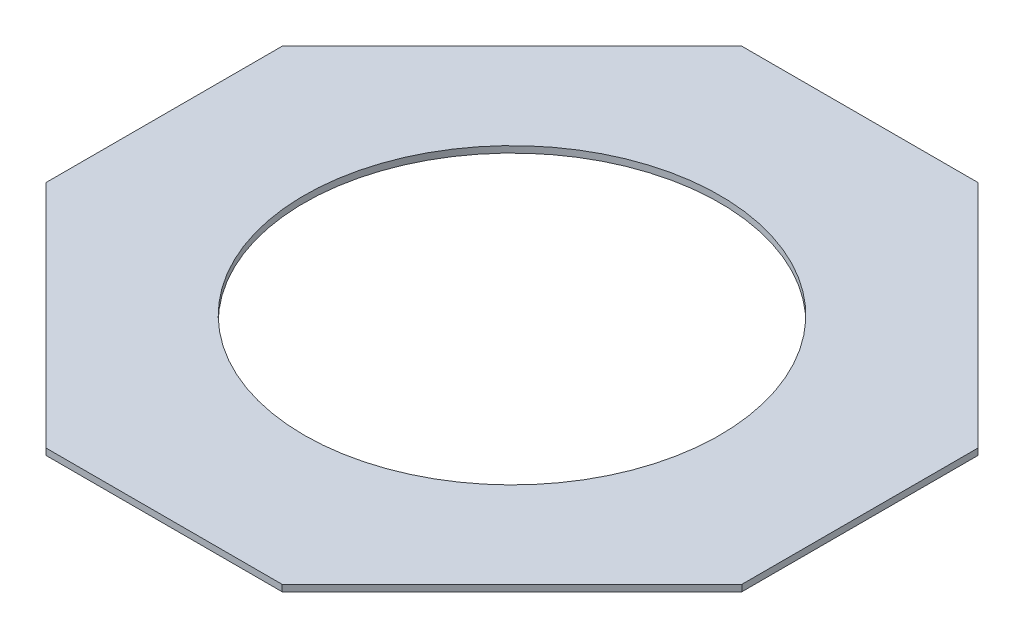
ISO-10303-21;
HEADER;
FILE_DESCRIPTION(('STEP AP214'),'2;1');
FILE_NAME('part.step','',(''),(''),'','','');
FILE_SCHEMA(('AUTOMOTIVE_DESIGN { 1 0 10303 214 1 1 1 1 }'));
ENDSEC;
DATA;
#1=APPLICATION_CONTEXT('core data for automotive mechanical design processes');
#2=APPLICATION_PROTOCOL_DEFINITION('international standard','automotive_design',2000,#1);
#3=PRODUCT_CONTEXT('',#1,'mechanical');
#4=PRODUCT('Part','Part','',(#3));
#5=PRODUCT_RELATED_PRODUCT_CATEGORY('part','',(#4));
#6=PRODUCT_DEFINITION_FORMATION('','',#4);
#7=PRODUCT_DEFINITION_CONTEXT('part definition',#1,'design');
#8=PRODUCT_DEFINITION('design','',#6,#7);
#9=PRODUCT_DEFINITION_SHAPE('','',#8);
#10=(LENGTH_UNIT() NAMED_UNIT(*) SI_UNIT(.MILLI.,.METRE.));
#11=(NAMED_UNIT(*) PLANE_ANGLE_UNIT() SI_UNIT($,.RADIAN.));
#12=(NAMED_UNIT(*) SI_UNIT($,.STERADIAN.) SOLID_ANGLE_UNIT());
#13=UNCERTAINTY_MEASURE_WITH_UNIT(LENGTH_MEASURE(1.E-05),#10,'distance_accuracy_value','');
#14=(GEOMETRIC_REPRESENTATION_CONTEXT(3) GLOBAL_UNCERTAINTY_ASSIGNED_CONTEXT((#13)) GLOBAL_UNIT_ASSIGNED_CONTEXT((#10,
#11,#12)) REPRESENTATION_CONTEXT('',''));
#15=CARTESIAN_POINT('',(0.,0.,0.));
#16=DIRECTION('',(0.,0.,1.));
#17=DIRECTION('',(1.,0.,0.));
#18=AXIS2_PLACEMENT_3D('',#15,#16,#17);
#19=CARTESIAN_POINT('',(0.,1.3,0.));
#20=DIRECTION('',(0.,1.,0.));
#21=DIRECTION('',(0.,0.,1.));
#22=AXIS2_PLACEMENT_3D('',#19,#20,#21);
#23=PLANE('',#22);
#24=DIRECTION('',(-0.707106781186547,0.,0.707106781186547));
#25=VECTOR('',#24,1.);
#26=CARTESIAN_POINT('',(70.,1.3,23.75));
#27=LINE('',#26,#25);
#28=CARTESIAN_POINT('',(70.,1.3,23.75));
#29=VERTEX_POINT('',#28);
#30=CARTESIAN_POINT('',(23.75,1.3,70.));
#31=VERTEX_POINT('',#30);
#32=EDGE_CURVE('E187',#29,#31,#27,.T.);
#33=ORIENTED_EDGE('',*,*,#32,.F.);
#34=DIRECTION('',(0.,0.,-1.));
#35=VECTOR('',#34,1.);
#36=CARTESIAN_POINT('',(70.,1.3,23.75));
#37=LINE('',#36,#35);
#38=CARTESIAN_POINT('',(70.,1.3,-23.75));
#39=VERTEX_POINT('',#38);
#40=EDGE_CURVE('E146',#29,#39,#37,.T.);
#41=ORIENTED_EDGE('',*,*,#40,.T.);
#42=DIRECTION('',(-0.707106781186547,0.,-0.707106781186547));
#43=VECTOR('',#42,1.);
#44=CARTESIAN_POINT('',(70.,1.3,-23.75));
#45=LINE('',#44,#43);
#46=CARTESIAN_POINT('',(23.75,1.3,-70.));
#47=VERTEX_POINT('',#46);
#48=EDGE_CURVE('E138',#39,#47,#45,.T.);
#49=ORIENTED_EDGE('',*,*,#48,.T.);
#50=DIRECTION('',(-1.,0.,0.));
#51=VECTOR('',#50,1.);
#52=CARTESIAN_POINT('',(23.75,1.3,-70.));
#53=LINE('',#52,#51);
#54=CARTESIAN_POINT('',(-23.75,1.3,-70.));
#55=VERTEX_POINT('',#54);
#56=EDGE_CURVE('E144',#47,#55,#53,.T.);
#57=ORIENTED_EDGE('',*,*,#56,.T.);
#58=DIRECTION('',(0.707106781186547,0.,-0.707106781186547));
#59=VECTOR('',#58,1.);
#60=CARTESIAN_POINT('',(-70.,1.3,-23.75));
#61=LINE('',#60,#59);
#62=CARTESIAN_POINT('',(-70.,1.3,-23.75));
#63=VERTEX_POINT('',#62);
#64=EDGE_CURVE('E161',#63,#55,#61,.T.);
#65=ORIENTED_EDGE('',*,*,#64,.F.);
#66=DIRECTION('',(0.,0.,-1.));
#67=VECTOR('',#66,1.);
#68=CARTESIAN_POINT('',(-70.,1.3,23.75));
#69=LINE('',#68,#67);
#70=CARTESIAN_POINT('',(-70.,1.3,23.75));
#71=VERTEX_POINT('',#70);
#72=EDGE_CURVE('E163',#71,#63,#69,.T.);
#73=ORIENTED_EDGE('',*,*,#72,.F.);
#74=DIRECTION('',(0.707106781186547,0.,0.707106781186547));
#75=VECTOR('',#74,1.);
#76=CARTESIAN_POINT('',(-70.,1.3,23.75));
#77=LINE('',#76,#75);
#78=CARTESIAN_POINT('',(-23.75,1.3,70.));
#79=VERTEX_POINT('',#78);
#80=EDGE_CURVE('E210',#71,#79,#77,.T.);
#81=ORIENTED_EDGE('',*,*,#80,.T.);
#82=DIRECTION('',(-1.,0.,0.));
#83=VECTOR('',#82,1.);
#84=CARTESIAN_POINT('',(23.75,1.3,70.));
#85=LINE('',#84,#83);
#86=EDGE_CURVE('E211',#31,#79,#85,.T.);
#87=ORIENTED_EDGE('',*,*,#86,.F.);
#88=EDGE_LOOP('',(#33,#41,#49,#57,#65,#73,#81,#87));
#89=FACE_BOUND('',#88,.T.);
#90=CARTESIAN_POINT('',(0.,1.3,0.));
#91=DIRECTION('',(0.,1.,0.));
#92=DIRECTION('',(0.,0.,1.));
#93=AXIS2_PLACEMENT_3D('',#90,#91,#92);
#94=CIRCLE('',#93,41.8);
#95=CARTESIAN_POINT('',(0.,1.3,41.8));
#96=VERTEX_POINT('',#95);
#97=EDGE_CURVE('E172',#96,#96,#94,.T.);
#98=ORIENTED_EDGE('',*,*,#97,.F.);
#99=EDGE_LOOP('',(#98));
#100=FACE_BOUND('',#99,.T.);
#101=ADVANCED_FACE('F68',(#89,#100),#23,.T.);
#102=CARTESIAN_POINT('',(0.,0.,0.));
#103=DIRECTION('',(0.,1.,0.));
#104=DIRECTION('',(0.,0.,1.));
#105=AXIS2_PLACEMENT_3D('',#102,#103,#104);
#106=PLANE('',#105);
#107=DIRECTION('',(-0.707106781186547,0.,0.707106781186547));
#108=VECTOR('',#107,1.);
#109=CARTESIAN_POINT('',(70.,0.,23.75));
#110=LINE('',#109,#108);
#111=CARTESIAN_POINT('',(70.,0.,23.75));
#112=VERTEX_POINT('',#111);
#113=CARTESIAN_POINT('',(23.75,0.,70.));
#114=VERTEX_POINT('',#113);
#115=EDGE_CURVE('E168',#112,#114,#110,.T.);
#116=ORIENTED_EDGE('',*,*,#115,.T.);
#117=DIRECTION('',(-1.,0.,0.));
#118=VECTOR('',#117,1.);
#119=CARTESIAN_POINT('',(23.75,0.,70.));
#120=LINE('',#119,#118);
#121=CARTESIAN_POINT('',(-23.75,0.,70.));
#122=VERTEX_POINT('',#121);
#123=EDGE_CURVE('E171',#114,#122,#120,.T.);
#124=ORIENTED_EDGE('',*,*,#123,.T.);
#125=DIRECTION('',(0.707106781186547,0.,0.707106781186547));
#126=VECTOR('',#125,1.);
#127=CARTESIAN_POINT('',(-70.,0.,23.75));
#128=LINE('',#127,#126);
#129=CARTESIAN_POINT('',(-70.,0.,23.75));
#130=VERTEX_POINT('',#129);
#131=EDGE_CURVE('E175',#130,#122,#128,.T.);
#132=ORIENTED_EDGE('',*,*,#131,.F.);
#133=DIRECTION('',(0.,0.,-1.));
#134=VECTOR('',#133,1.);
#135=CARTESIAN_POINT('',(-70.,0.,23.75));
#136=LINE('',#135,#134);
#137=CARTESIAN_POINT('',(-70.,0.,-23.75));
#138=VERTEX_POINT('',#137);
#139=EDGE_CURVE('E178',#130,#138,#136,.T.);
#140=ORIENTED_EDGE('',*,*,#139,.T.);
#141=DIRECTION('',(0.707106781186547,0.,-0.707106781186547));
#142=VECTOR('',#141,1.);
#143=CARTESIAN_POINT('',(-70.,0.,-23.75));
#144=LINE('',#143,#142);
#145=CARTESIAN_POINT('',(-23.75,0.,-70.));
#146=VERTEX_POINT('',#145);
#147=EDGE_CURVE('E181',#138,#146,#144,.T.);
#148=ORIENTED_EDGE('',*,*,#147,.T.);
#149=DIRECTION('',(-1.,0.,0.));
#150=VECTOR('',#149,1.);
#151=CARTESIAN_POINT('',(23.75,0.,-70.));
#152=LINE('',#151,#150);
#153=CARTESIAN_POINT('',(23.75,0.,-70.));
#154=VERTEX_POINT('',#153);
#155=EDGE_CURVE('E184',#154,#146,#152,.T.);
#156=ORIENTED_EDGE('',*,*,#155,.F.);
#157=DIRECTION('',(-0.707106781186547,0.,-0.707106781186547));
#158=VECTOR('',#157,1.);
#159=CARTESIAN_POINT('',(70.,0.,-23.75));
#160=LINE('',#159,#158);
#161=CARTESIAN_POINT('',(70.,0.,-23.75));
#162=VERTEX_POINT('',#161);
#163=EDGE_CURVE('E153',#162,#154,#160,.T.);
#164=ORIENTED_EDGE('',*,*,#163,.F.);
#165=DIRECTION('',(0.,0.,-1.));
#166=VECTOR('',#165,1.);
#167=CARTESIAN_POINT('',(70.,0.,23.75));
#168=LINE('',#167,#166);
#169=EDGE_CURVE('E114',#112,#162,#168,.T.);
#170=ORIENTED_EDGE('',*,*,#169,.F.);
#171=EDGE_LOOP('',(#116,#124,#132,#140,#148,#156,#164,#170));
#172=FACE_BOUND('',#171,.T.);
#173=CARTESIAN_POINT('',(0.,0.,0.));
#174=DIRECTION('',(0.,1.,0.));
#175=DIRECTION('',(0.,0.,1.));
#176=AXIS2_PLACEMENT_3D('',#173,#174,#175);
#177=CIRCLE('',#176,41.8);
#178=CARTESIAN_POINT('',(0.,0.,41.8));
#179=VERTEX_POINT('',#178);
#180=EDGE_CURVE('E216',#179,#179,#177,.T.);
#181=ORIENTED_EDGE('',*,*,#180,.T.);
#182=EDGE_LOOP('',(#181));
#183=FACE_BOUND('',#182,.T.);
#184=ADVANCED_FACE('F199',(#172,#183),#106,.F.);
#185=CARTESIAN_POINT('',(70.,1.3,23.75));
#186=DIRECTION('',(0.707106781186548,0.,0.707106781186548));
#187=DIRECTION('',(0.707106781186548,0.,-0.707106781186548));
#188=AXIS2_PLACEMENT_3D('',#185,#186,#187);
#189=PLANE('',#188);
#190=ORIENTED_EDGE('',*,*,#115,.F.);
#191=DIRECTION('',(0.,-1.,0.));
#192=VECTOR('',#191,1.);
#193=CARTESIAN_POINT('',(70.,1.3,23.75));
#194=LINE('',#193,#192);
#195=EDGE_CURVE('E12',#29,#112,#194,.T.);
#196=ORIENTED_EDGE('',*,*,#195,.F.);
#197=ORIENTED_EDGE('',*,*,#32,.T.);
#198=DIRECTION('',(0.,-1.,0.));
#199=VECTOR('',#198,1.);
#200=CARTESIAN_POINT('',(23.75,1.3,70.));
#201=LINE('',#200,#199);
#202=EDGE_CURVE('E72',#31,#114,#201,.T.);
#203=ORIENTED_EDGE('',*,*,#202,.T.);
#204=EDGE_LOOP('',(#190,#196,#197,#203));
#205=FACE_BOUND('',#204,.T.);
#206=ADVANCED_FACE('F70',(#205),#189,.T.);
#207=CARTESIAN_POINT('',(70.,1.3,23.75));
#208=DIRECTION('',(-1.,0.,0.));
#209=DIRECTION('',(0.,0.,1.));
#210=AXIS2_PLACEMENT_3D('',#207,#208,#209);
#211=PLANE('',#210);
#212=ORIENTED_EDGE('',*,*,#169,.T.);
#213=DIRECTION('',(0.,-1.,0.));
#214=VECTOR('',#213,1.);
#215=CARTESIAN_POINT('',(70.,1.3,-23.75));
#216=LINE('',#215,#214);
#217=EDGE_CURVE('E78',#39,#162,#216,.T.);
#218=ORIENTED_EDGE('',*,*,#217,.F.);
#219=ORIENTED_EDGE('',*,*,#40,.F.);
#220=ORIENTED_EDGE('',*,*,#195,.T.);
#221=EDGE_LOOP('',(#212,#218,#219,#220));
#222=FACE_BOUND('',#221,.T.);
#223=ADVANCED_FACE('F232',(#222),#211,.F.);
#224=CARTESIAN_POINT('',(70.,1.3,-23.75));
#225=DIRECTION('',(-0.707106781186548,0.,0.707106781186548));
#226=DIRECTION('',(0.707106781186548,0.,0.707106781186548));
#227=AXIS2_PLACEMENT_3D('',#224,#225,#226);
#228=PLANE('',#227);
#229=ORIENTED_EDGE('',*,*,#163,.T.);
#230=DIRECTION('',(0.,-1.,0.));
#231=VECTOR('',#230,1.);
#232=CARTESIAN_POINT('',(23.75,1.3,-70.));
#233=LINE('',#232,#231);
#234=EDGE_CURVE('E150',#47,#154,#233,.T.);
#235=ORIENTED_EDGE('',*,*,#234,.F.);
#236=ORIENTED_EDGE('',*,*,#48,.F.);
#237=ORIENTED_EDGE('',*,*,#217,.T.);
#238=EDGE_LOOP('',(#229,#235,#236,#237));
#239=FACE_BOUND('',#238,.T.);
#240=ADVANCED_FACE('F151',(#239),#228,.F.);
#241=CARTESIAN_POINT('',(23.75,1.3,-70.));
#242=DIRECTION('',(0.,0.,1.));
#243=DIRECTION('',(1.,0.,0.));
#244=AXIS2_PLACEMENT_3D('',#241,#242,#243);
#245=PLANE('',#244);
#246=ORIENTED_EDGE('',*,*,#155,.T.);
#247=DIRECTION('',(0.,-1.,0.));
#248=VECTOR('',#247,1.);
#249=CARTESIAN_POINT('',(-23.75,1.3,-70.));
#250=LINE('',#249,#248);
#251=EDGE_CURVE('E157',#55,#146,#250,.T.);
#252=ORIENTED_EDGE('',*,*,#251,.F.);
#253=ORIENTED_EDGE('',*,*,#56,.F.);
#254=ORIENTED_EDGE('',*,*,#234,.T.);
#255=EDGE_LOOP('',(#246,#252,#253,#254));
#256=FACE_BOUND('',#255,.T.);
#257=ADVANCED_FACE('F159',(#256),#245,.F.);
#258=CARTESIAN_POINT('',(-70.,1.3,-23.75));
#259=DIRECTION('',(-0.707106781186548,0.,-0.707106781186548));
#260=DIRECTION('',(-0.707106781186548,0.,0.707106781186548));
#261=AXIS2_PLACEMENT_3D('',#258,#259,#260);
#262=PLANE('',#261);
#263=ORIENTED_EDGE('',*,*,#147,.F.);
#264=DIRECTION('',(0.,-1.,0.));
#265=VECTOR('',#264,1.);
#266=CARTESIAN_POINT('',(-70.,1.3,-23.75));
#267=LINE('',#266,#265);
#268=EDGE_CURVE('E191',#63,#138,#267,.T.);
#269=ORIENTED_EDGE('',*,*,#268,.F.);
#270=ORIENTED_EDGE('',*,*,#64,.T.);
#271=ORIENTED_EDGE('',*,*,#251,.T.);
#272=EDGE_LOOP('',(#263,#269,#270,#271));
#273=FACE_BOUND('',#272,.T.);
#274=ADVANCED_FACE('F204',(#273),#262,.T.);
#275=CARTESIAN_POINT('',(-70.,1.3,23.75));
#276=DIRECTION('',(-1.,0.,0.));
#277=DIRECTION('',(0.,0.,1.));
#278=AXIS2_PLACEMENT_3D('',#275,#276,#277);
#279=PLANE('',#278);
#280=ORIENTED_EDGE('',*,*,#139,.F.);
#281=DIRECTION('',(0.,-1.,0.));
#282=VECTOR('',#281,1.);
#283=CARTESIAN_POINT('',(-70.,1.3,23.75));
#284=LINE('',#283,#282);
#285=EDGE_CURVE('E193',#71,#130,#284,.T.);
#286=ORIENTED_EDGE('',*,*,#285,.F.);
#287=ORIENTED_EDGE('',*,*,#72,.T.);
#288=ORIENTED_EDGE('',*,*,#268,.T.);
#289=EDGE_LOOP('',(#280,#286,#287,#288));
#290=FACE_BOUND('',#289,.T.);
#291=ADVANCED_FACE('F208',(#290),#279,.T.);
#292=CARTESIAN_POINT('',(-70.,1.3,23.75));
#293=DIRECTION('',(0.707106781186548,0.,-0.707106781186548));
#294=DIRECTION('',(-0.707106781186548,0.,-0.707106781186548));
#295=AXIS2_PLACEMENT_3D('',#292,#293,#294);
#296=PLANE('',#295);
#297=ORIENTED_EDGE('',*,*,#131,.T.);
#298=DIRECTION('',(0.,-1.,0.));
#299=VECTOR('',#298,1.);
#300=CARTESIAN_POINT('',(-23.75,1.3,70.));
#301=LINE('',#300,#299);
#302=EDGE_CURVE('E194',#79,#122,#301,.T.);
#303=ORIENTED_EDGE('',*,*,#302,.F.);
#304=ORIENTED_EDGE('',*,*,#80,.F.);
#305=ORIENTED_EDGE('',*,*,#285,.T.);
#306=EDGE_LOOP('',(#297,#303,#304,#305));
#307=FACE_BOUND('',#306,.T.);
#308=ADVANCED_FACE('F243',(#307),#296,.F.);
#309=CARTESIAN_POINT('',(23.75,1.3,70.));
#310=DIRECTION('',(0.,0.,1.));
#311=DIRECTION('',(1.,0.,0.));
#312=AXIS2_PLACEMENT_3D('',#309,#310,#311);
#313=PLANE('',#312);
#314=ORIENTED_EDGE('',*,*,#123,.F.);
#315=ORIENTED_EDGE('',*,*,#202,.F.);
#316=ORIENTED_EDGE('',*,*,#86,.T.);
#317=ORIENTED_EDGE('',*,*,#302,.T.);
#318=EDGE_LOOP('',(#314,#315,#316,#317));
#319=FACE_BOUND('',#318,.T.);
#320=ADVANCED_FACE('F196',(#319),#313,.T.);
#321=CARTESIAN_POINT('',(0.,1.3,0.));
#322=DIRECTION('',(0.,-1.,0.));
#323=DIRECTION('',(0.,0.,-1.));
#324=AXIS2_PLACEMENT_3D('',#321,#322,#323);
#325=CYLINDRICAL_SURFACE('',#324,41.8);
#326=ORIENTED_EDGE('',*,*,#97,.T.);
#327=EDGE_LOOP('',(#326));
#328=FACE_BOUND('',#327,.T.);
#329=ORIENTED_EDGE('',*,*,#180,.F.);
#330=EDGE_LOOP('',(#329));
#331=FACE_BOUND('',#330,.T.);
#332=ADVANCED_FACE('F222',(#328,#331),#325,.F.);
#333=CLOSED_SHELL('',(#101,#184,#206,#223,#240,#257,#274,#291,#308,#320,#332));
#334=MANIFOLD_SOLID_BREP('B2',#333);
#335=ADVANCED_BREP_SHAPE_REPRESENTATION('',(#18,#334),#14);
#336=SHAPE_DEFINITION_REPRESENTATION(#9,#335);
ENDSEC;
END-ISO-10303-21;
